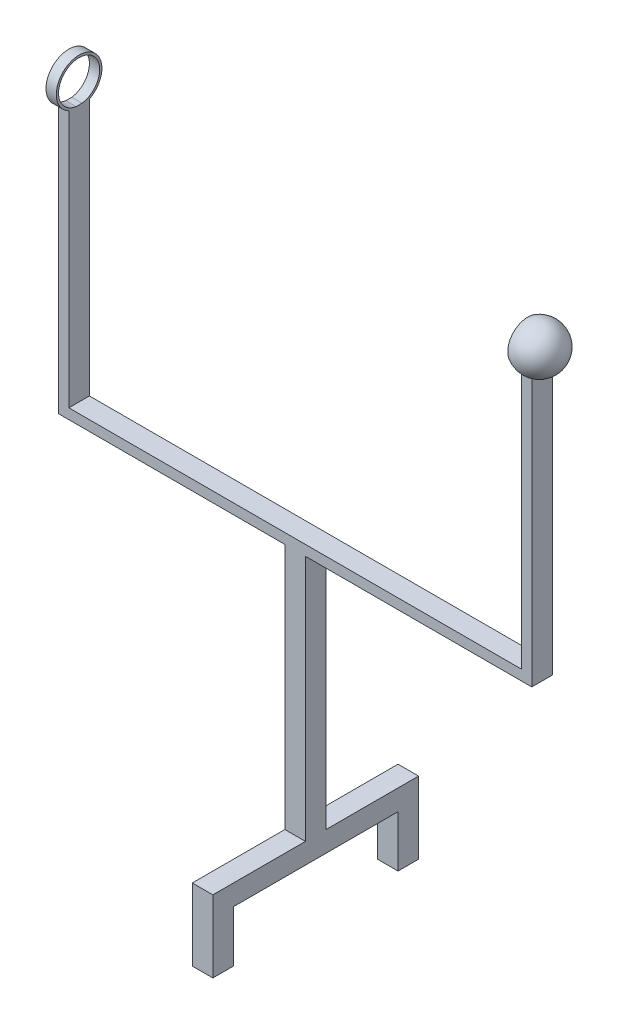
ISO-10303-21;
HEADER;
FILE_DESCRIPTION(('STEP AP214'),'2;1');
FILE_NAME('part.step','',(''),(''),'','','');
FILE_SCHEMA(('AUTOMOTIVE_DESIGN { 1 0 10303 214 1 1 1 1 }'));
ENDSEC;
DATA;
#1=APPLICATION_CONTEXT('core data for automotive mechanical design processes');
#2=APPLICATION_PROTOCOL_DEFINITION('international standard','automotive_design',2000,#1);
#3=PRODUCT_CONTEXT('',#1,'mechanical');
#4=PRODUCT('Part','Part','',(#3));
#5=PRODUCT_RELATED_PRODUCT_CATEGORY('part','',(#4));
#6=PRODUCT_DEFINITION_FORMATION('','',#4);
#7=PRODUCT_DEFINITION_CONTEXT('part definition',#1,'design');
#8=PRODUCT_DEFINITION('design','',#6,#7);
#9=PRODUCT_DEFINITION_SHAPE('','',#8);
#10=(LENGTH_UNIT() NAMED_UNIT(*) SI_UNIT(.MILLI.,.METRE.));
#11=(NAMED_UNIT(*) PLANE_ANGLE_UNIT() SI_UNIT($,.RADIAN.));
#12=(NAMED_UNIT(*) SI_UNIT($,.STERADIAN.) SOLID_ANGLE_UNIT());
#13=UNCERTAINTY_MEASURE_WITH_UNIT(LENGTH_MEASURE(1.E-05),#10,'distance_accuracy_value','');
#14=(GEOMETRIC_REPRESENTATION_CONTEXT(3) GLOBAL_UNCERTAINTY_ASSIGNED_CONTEXT((#13)) GLOBAL_UNIT_ASSIGNED_CONTEXT((#10,
#11,#12)) REPRESENTATION_CONTEXT('',''));
#15=CARTESIAN_POINT('',(0.,0.,0.));
#16=DIRECTION('',(0.,0.,1.));
#17=DIRECTION('',(1.,0.,0.));
#18=AXIS2_PLACEMENT_3D('',#15,#16,#17);
#19=CARTESIAN_POINT('',(-44.,100.,-2.));
#20=DIRECTION('',(0.,-1.,0.));
#21=DIRECTION('',(0.,0.,-1.));
#22=AXIS2_PLACEMENT_3D('',#19,#20,#21);
#23=PLANE('',#22);
#24=DIRECTION('',(-1.,0.,0.));
#25=VECTOR('',#24,1.);
#26=CARTESIAN_POINT('',(-31.4553608105313,100.,0.573588224038669));
#27=LINE('',#26,#25);
#28=CARTESIAN_POINT('',(-44.,100.,0.573588224038669));
#29=VERTEX_POINT('',#28);
#30=CARTESIAN_POINT('',(-46.,100.,0.573588224038669));
#31=VERTEX_POINT('',#30);
#32=EDGE_CURVE('E209',#29,#31,#27,.T.);
#33=ORIENTED_EDGE('',*,*,#32,.F.);
#34=DIRECTION('',(0.,0.,1.));
#35=VECTOR('',#34,1.);
#36=CARTESIAN_POINT('',(-44.,100.,-2.));
#37=LINE('',#36,#35);
#38=CARTESIAN_POINT('',(-44.,100.,-0.573588224038669));
#39=VERTEX_POINT('',#38);
#40=EDGE_CURVE('E218',#39,#29,#37,.T.);
#41=ORIENTED_EDGE('',*,*,#40,.F.);
#42=DIRECTION('',(-1.,0.,0.));
#43=VECTOR('',#42,1.);
#44=CARTESIAN_POINT('',(-31.4553608105313,100.,-0.573588224038669));
#45=LINE('',#44,#43);
#46=CARTESIAN_POINT('',(-46.,100.,-0.573588224038669));
#47=VERTEX_POINT('',#46);
#48=EDGE_CURVE('E212',#47,#39,#45,.F.);
#49=ORIENTED_EDGE('',*,*,#48,.F.);
#50=DIRECTION('',(0.,0.,1.));
#51=VECTOR('',#50,1.);
#52=CARTESIAN_POINT('',(-46.,100.,-2.));
#53=LINE('',#52,#51);
#54=EDGE_CURVE('E220',#47,#31,#53,.T.);
#55=ORIENTED_EDGE('',*,*,#54,.T.);
#56=EDGE_LOOP('',(#33,#41,#49,#55));
#57=FACE_BOUND('',#56,.T.);
#58=ADVANCED_FACE('F33',(#57),#23,.F.);
#59=CARTESIAN_POINT('',(-2.,-4.,20.));
#60=DIRECTION('',(0.,1.,0.));
#61=DIRECTION('',(-1.,0.,0.));
#62=AXIS2_PLACEMENT_3D('',#59,#60,#61);
#63=PLANE('',#62);
#64=DIRECTION('',(0.,0.,-1.));
#65=VECTOR('',#64,1.);
#66=CARTESIAN_POINT('',(-2.,-4.,20.));
#67=LINE('',#66,#65);
#68=CARTESIAN_POINT('',(-2.,-4.,16.));
#69=VERTEX_POINT('',#68);
#70=CARTESIAN_POINT('',(-2.,-4.,-16.));
#71=VERTEX_POINT('',#70);
#72=EDGE_CURVE('E406',#69,#71,#67,.T.);
#73=ORIENTED_EDGE('',*,*,#72,.T.);
#74=DIRECTION('',(1.,0.,0.));
#75=VECTOR('',#74,1.);
#76=CARTESIAN_POINT('',(-2.,-4.,-16.));
#77=LINE('',#76,#75);
#78=CARTESIAN_POINT('',(2.,-4.,-16.));
#79=VERTEX_POINT('',#78);
#80=EDGE_CURVE('E55',#71,#79,#77,.T.);
#81=ORIENTED_EDGE('',*,*,#80,.T.);
#82=DIRECTION('',(0.,0.,-1.));
#83=VECTOR('',#82,1.);
#84=CARTESIAN_POINT('',(2.,-4.,20.));
#85=LINE('',#84,#83);
#86=CARTESIAN_POINT('',(2.,-4.,16.));
#87=VERTEX_POINT('',#86);
#88=EDGE_CURVE('E407',#87,#79,#85,.T.);
#89=ORIENTED_EDGE('',*,*,#88,.F.);
#90=DIRECTION('',(1.,0.,0.));
#91=VECTOR('',#90,1.);
#92=CARTESIAN_POINT('',(-2.,-4.,16.));
#93=LINE('',#92,#91);
#94=EDGE_CURVE('E424',#69,#87,#93,.T.);
#95=ORIENTED_EDGE('',*,*,#94,.F.);
#96=EDGE_LOOP('',(#73,#81,#89,#95));
#97=FACE_BOUND('',#96,.T.);
#98=ADVANCED_FACE('F484',(#97),#63,.F.);
#99=CARTESIAN_POINT('',(44.,100.,-2.));
#100=DIRECTION('',(0.,1.,0.));
#101=DIRECTION('',(0.,0.,1.));
#102=AXIS2_PLACEMENT_3D('',#99,#100,#101);
#103=PLANE('',#102);
#104=CARTESIAN_POINT('',(45.4806811737032,100.,0.));
#105=DIRECTION('',(0.,1.,0.));
#106=DIRECTION('',(0.,0.,1.));
#107=AXIS2_PLACEMENT_3D('',#104,#105,#106);
#108=CIRCLE('',#107,2.06155281280883);
#109=CARTESIAN_POINT('',(45.9806811737031,100.,2.));
#110=VERTEX_POINT('',#109);
#111=CARTESIAN_POINT('',(46.,100.,1.99507091519416));
#112=VERTEX_POINT('',#111);
#113=EDGE_CURVE('E241',#110,#112,#108,.T.);
#114=ORIENTED_EDGE('',*,*,#113,.F.);
#115=DIRECTION('',(-1.,0.,0.));
#116=VECTOR('',#115,1.);
#117=CARTESIAN_POINT('',(44.,100.,2.));
#118=LINE('',#117,#116);
#119=CARTESIAN_POINT('',(46.,100.,2.));
#120=VERTEX_POINT('',#119);
#121=EDGE_CURVE('E263',#120,#110,#118,.T.);
#122=ORIENTED_EDGE('',*,*,#121,.F.);
#123=DIRECTION('',(0.,0.,1.));
#124=VECTOR('',#123,1.);
#125=CARTESIAN_POINT('',(46.,100.,-2.));
#126=LINE('',#125,#124);
#127=EDGE_CURVE('E300',#112,#120,#126,.T.);
#128=ORIENTED_EDGE('',*,*,#127,.F.);
#129=EDGE_LOOP('',(#114,#122,#128));
#130=FACE_BOUND('',#129,.T.);
#131=ADVANCED_FACE('F332',(#130),#103,.T.);
#132=CARTESIAN_POINT('',(46.,100.,-1.99507091519416));
#133=VERTEX_POINT('',#132);
#134=CARTESIAN_POINT('',(45.9806811737031,100.,-2.));
#135=VERTEX_POINT('',#134);
#136=EDGE_CURVE('E242',#133,#135,#108,.T.);
#137=ORIENTED_EDGE('',*,*,#136,.F.);
#138=CARTESIAN_POINT('',(46.,100.,-2.));
#139=VERTEX_POINT('',#138);
#140=EDGE_CURVE('E297',#139,#133,#126,.T.);
#141=ORIENTED_EDGE('',*,*,#140,.F.);
#142=DIRECTION('',(-1.,0.,0.));
#143=VECTOR('',#142,1.);
#144=CARTESIAN_POINT('',(44.,100.,-2.));
#145=LINE('',#144,#143);
#146=EDGE_CURVE('E283',#139,#135,#145,.T.);
#147=ORIENTED_EDGE('',*,*,#146,.T.);
#148=EDGE_LOOP('',(#137,#141,#147));
#149=FACE_BOUND('',#148,.T.);
#150=ADVANCED_FACE('F326',(#149),#103,.T.);
#151=CARTESIAN_POINT('',(44.9806811737032,100.,-2.));
#152=VERTEX_POINT('',#151);
#153=CARTESIAN_POINT('',(44.,100.,-1.43442785173777));
#154=VERTEX_POINT('',#153);
#155=EDGE_CURVE('E247',#152,#154,#108,.T.);
#156=ORIENTED_EDGE('',*,*,#155,.F.);
#157=CARTESIAN_POINT('',(44.,100.,-2.));
#158=VERTEX_POINT('',#157);
#159=EDGE_CURVE('E282',#152,#158,#145,.T.);
#160=ORIENTED_EDGE('',*,*,#159,.T.);
#161=DIRECTION('',(0.,0.,1.));
#162=VECTOR('',#161,1.);
#163=CARTESIAN_POINT('',(44.,100.,-2.));
#164=LINE('',#163,#162);
#165=EDGE_CURVE('E293',#158,#154,#164,.T.);
#166=ORIENTED_EDGE('',*,*,#165,.T.);
#167=EDGE_LOOP('',(#156,#160,#166));
#168=FACE_BOUND('',#167,.T.);
#169=ADVANCED_FACE('F507',(#168),#103,.T.);
#170=CARTESIAN_POINT('',(0.,50.,-2.));
#171=DIRECTION('',(0.,1.,0.));
#172=DIRECTION('',(0.,0.,1.));
#173=AXIS2_PLACEMENT_3D('',#170,#171,#172);
#174=PLANE('',#173);
#175=DIRECTION('',(-1.,0.,0.));
#176=VECTOR('',#175,1.);
#177=CARTESIAN_POINT('',(0.,50.,-2.));
#178=LINE('',#177,#176);
#179=CARTESIAN_POINT('',(44.,50.,-2.));
#180=VERTEX_POINT('',#179);
#181=CARTESIAN_POINT('',(-44.,50.,-2.));
#182=VERTEX_POINT('',#181);
#183=EDGE_CURVE('E289',#180,#182,#178,.T.);
#184=ORIENTED_EDGE('',*,*,#183,.T.);
#185=DIRECTION('',(0.,0.,1.));
#186=VECTOR('',#185,1.);
#187=CARTESIAN_POINT('',(-44.,50.,-2.));
#188=LINE('',#187,#186);
#189=CARTESIAN_POINT('',(-44.,50.,2.));
#190=VERTEX_POINT('',#189);
#191=EDGE_CURVE('E223',#182,#190,#188,.T.);
#192=ORIENTED_EDGE('',*,*,#191,.T.);
#193=DIRECTION('',(-1.,0.,0.));
#194=VECTOR('',#193,1.);
#195=CARTESIAN_POINT('',(0.,50.,2.));
#196=LINE('',#195,#194);
#197=CARTESIAN_POINT('',(44.,50.,2.));
#198=VERTEX_POINT('',#197);
#199=EDGE_CURVE('E269',#198,#190,#196,.T.);
#200=ORIENTED_EDGE('',*,*,#199,.F.);
#201=DIRECTION('',(0.,0.,1.));
#202=VECTOR('',#201,1.);
#203=CARTESIAN_POINT('',(44.,50.,-2.));
#204=LINE('',#203,#202);
#205=EDGE_CURVE('E41',#180,#198,#204,.T.);
#206=ORIENTED_EDGE('',*,*,#205,.F.);
#207=EDGE_LOOP('',(#184,#192,#200,#206));
#208=FACE_BOUND('',#207,.T.);
#209=ADVANCED_FACE('F347',(#208),#174,.T.);
#210=CARTESIAN_POINT('',(44.,50.,-2.));
#211=DIRECTION('',(-1.,0.,0.));
#212=DIRECTION('',(0.,0.,1.));
#213=AXIS2_PLACEMENT_3D('',#210,#211,#212);
#214=PLANE('',#213);
#215=CARTESIAN_POINT('',(44.,104.,0.));
#216=DIRECTION('',(-1.,0.,0.));
#217=DIRECTION('',(0.,0.,1.));
#218=AXIS2_PLACEMENT_3D('',#215,#216,#217);
#219=CIRCLE('',#218,4.24942152084741);
#220=CARTESIAN_POINT('',(44.,100.,1.43442785173777));
#221=VERTEX_POINT('',#220);
#222=EDGE_CURVE('E243',#154,#221,#219,.T.);
#223=ORIENTED_EDGE('',*,*,#222,.F.);
#224=ORIENTED_EDGE('',*,*,#165,.F.);
#225=DIRECTION('',(0.,-1.,0.));
#226=VECTOR('',#225,1.);
#227=CARTESIAN_POINT('',(44.,50.,-2.));
#228=LINE('',#227,#226);
#229=EDGE_CURVE('E286',#158,#180,#228,.T.);
#230=ORIENTED_EDGE('',*,*,#229,.T.);
#231=ORIENTED_EDGE('',*,*,#205,.T.);
#232=DIRECTION('',(0.,-1.,0.));
#233=VECTOR('',#232,1.);
#234=CARTESIAN_POINT('',(44.,50.,2.));
#235=LINE('',#234,#233);
#236=CARTESIAN_POINT('',(44.,100.,2.));
#237=VERTEX_POINT('',#236);
#238=EDGE_CURVE('E266',#237,#198,#235,.T.);
#239=ORIENTED_EDGE('',*,*,#238,.F.);
#240=EDGE_CURVE('E296',#221,#237,#164,.T.);
#241=ORIENTED_EDGE('',*,*,#240,.F.);
#242=EDGE_LOOP('',(#223,#224,#230,#231,#239,#241));
#243=FACE_BOUND('',#242,.T.);
#244=ADVANCED_FACE('F342',(#243),#214,.T.);
#245=CARTESIAN_POINT('',(44.9806811737032,100.,2.));
#246=VERTEX_POINT('',#245);
#247=EDGE_CURVE('E239',#221,#246,#108,.T.);
#248=ORIENTED_EDGE('',*,*,#247,.F.);
#249=ORIENTED_EDGE('',*,*,#240,.T.);
#250=EDGE_CURVE('E262',#246,#237,#118,.T.);
#251=ORIENTED_EDGE('',*,*,#250,.F.);
#252=EDGE_LOOP('',(#248,#249,#251));
#253=FACE_BOUND('',#252,.T.);
#254=ADVANCED_FACE('F338',(#253),#103,.T.);
#255=CARTESIAN_POINT('',(46.,100.,-2.));
#256=DIRECTION('',(1.,0.,0.));
#257=DIRECTION('',(0.,1.,0.));
#258=AXIS2_PLACEMENT_3D('',#255,#256,#257);
#259=PLANE('',#258);
#260=CARTESIAN_POINT('',(46.,104.,0.));
#261=DIRECTION('',(1.,0.,0.));
#262=DIRECTION('',(0.,1.,0.));
#263=AXIS2_PLACEMENT_3D('',#260,#261,#262);
#264=CIRCLE('',#263,4.46993377542148);
#265=EDGE_CURVE('E245',#112,#133,#264,.T.);
#266=ORIENTED_EDGE('',*,*,#265,.F.);
#267=ORIENTED_EDGE('',*,*,#127,.T.);
#268=DIRECTION('',(0.,1.,0.));
#269=VECTOR('',#268,1.);
#270=CARTESIAN_POINT('',(46.,100.,2.));
#271=LINE('',#270,#269);
#272=CARTESIAN_POINT('',(46.,48.,2.));
#273=VERTEX_POINT('',#272);
#274=EDGE_CURVE('E259',#273,#120,#271,.T.);
#275=ORIENTED_EDGE('',*,*,#274,.F.);
#276=DIRECTION('',(0.,0.,1.));
#277=VECTOR('',#276,1.);
#278=CARTESIAN_POINT('',(46.,48.,-2.));
#279=LINE('',#278,#277);
#280=CARTESIAN_POINT('',(46.,48.,-2.));
#281=VERTEX_POINT('',#280);
#282=EDGE_CURVE('E301',#281,#273,#279,.T.);
#283=ORIENTED_EDGE('',*,*,#282,.F.);
#284=DIRECTION('',(0.,1.,0.));
#285=VECTOR('',#284,1.);
#286=CARTESIAN_POINT('',(46.,100.,-2.));
#287=LINE('',#286,#285);
#288=EDGE_CURVE('E279',#281,#139,#287,.T.);
#289=ORIENTED_EDGE('',*,*,#288,.T.);
#290=ORIENTED_EDGE('',*,*,#140,.T.);
#291=EDGE_LOOP('',(#266,#267,#275,#283,#289,#290));
#292=FACE_BOUND('',#291,.T.);
#293=ADVANCED_FACE('F318',(#292),#259,.T.);
#294=CARTESIAN_POINT('',(46.,48.,-2.));
#295=DIRECTION('',(0.,-1.,0.));
#296=DIRECTION('',(1.,0.,0.));
#297=AXIS2_PLACEMENT_3D('',#294,#295,#296);
#298=PLANE('',#297);
#299=ORIENTED_EDGE('',*,*,#282,.T.);
#300=DIRECTION('',(1.,0.,0.));
#301=VECTOR('',#300,1.);
#302=CARTESIAN_POINT('',(46.,48.,2.));
#303=LINE('',#302,#301);
#304=CARTESIAN_POINT('',(2.,48.,2.));
#305=VERTEX_POINT('',#304);
#306=EDGE_CURVE('E256',#305,#273,#303,.T.);
#307=ORIENTED_EDGE('',*,*,#306,.F.);
#308=DIRECTION('',(0.,0.,1.));
#309=VECTOR('',#308,1.);
#310=CARTESIAN_POINT('',(2.,48.,-2.));
#311=LINE('',#310,#309);
#312=CARTESIAN_POINT('',(2.,48.,-2.));
#313=VERTEX_POINT('',#312);
#314=EDGE_CURVE('E291',#313,#305,#311,.T.);
#315=ORIENTED_EDGE('',*,*,#314,.F.);
#316=DIRECTION('',(1.,0.,0.));
#317=VECTOR('',#316,1.);
#318=CARTESIAN_POINT('',(46.,48.,-2.));
#319=LINE('',#318,#317);
#320=EDGE_CURVE('E276',#313,#281,#319,.T.);
#321=ORIENTED_EDGE('',*,*,#320,.T.);
#322=EDGE_LOOP('',(#299,#307,#315,#321));
#323=FACE_BOUND('',#322,.T.);
#324=ADVANCED_FACE('F314',(#323),#298,.T.);
#325=CARTESIAN_POINT('',(2.,48.,-2.));
#326=DIRECTION('',(1.,0.,0.));
#327=DIRECTION('',(0.,1.,0.));
#328=AXIS2_PLACEMENT_3D('',#325,#326,#327);
#329=PLANE('',#328);
#330=ORIENTED_EDGE('',*,*,#314,.T.);
#331=DIRECTION('',(0.,1.,0.));
#332=VECTOR('',#331,1.);
#333=CARTESIAN_POINT('',(2.,48.,2.));
#334=LINE('',#333,#332);
#335=CARTESIAN_POINT('',(2.,0.,2.));
#336=VERTEX_POINT('',#335);
#337=EDGE_CURVE('E253',#336,#305,#334,.T.);
#338=ORIENTED_EDGE('',*,*,#337,.F.);
#339=DIRECTION('',(0.,0.,-1.));
#340=VECTOR('',#339,1.);
#341=CARTESIAN_POINT('',(2.,0.,20.));
#342=LINE('',#341,#340);
#343=CARTESIAN_POINT('',(2.,0.,20.));
#344=VERTEX_POINT('',#343);
#345=EDGE_CURVE('E358',#344,#336,#342,.T.);
#346=ORIENTED_EDGE('',*,*,#345,.F.);
#347=DIRECTION('',(0.,1.,0.));
#348=VECTOR('',#347,1.);
#349=CARTESIAN_POINT('',(2.,-4.,20.));
#350=LINE('',#349,#348);
#351=CARTESIAN_POINT('',(2.00000000000001,-14.,20.));
#352=VERTEX_POINT('',#351);
#353=EDGE_CURVE('E414',#352,#344,#350,.T.);
#354=ORIENTED_EDGE('',*,*,#353,.F.);
#355=DIRECTION('',(0.,0.,1.));
#356=VECTOR('',#355,1.);
#357=CARTESIAN_POINT('',(2.00000000000001,-14.,20.));
#358=LINE('',#357,#356);
#359=CARTESIAN_POINT('',(2.00000000000001,-14.,16.));
#360=VERTEX_POINT('',#359);
#361=EDGE_CURVE('E431',#360,#352,#358,.T.);
#362=ORIENTED_EDGE('',*,*,#361,.F.);
#363=DIRECTION('',(0.,1.,0.));
#364=VECTOR('',#363,1.);
#365=CARTESIAN_POINT('',(2.00000000000001,-14.,16.));
#366=LINE('',#365,#364);
#367=EDGE_CURVE('E420',#360,#87,#366,.T.);
#368=ORIENTED_EDGE('',*,*,#367,.T.);
#369=ORIENTED_EDGE('',*,*,#88,.T.);
#370=DIRECTION('',(0.,1.,0.));
#371=VECTOR('',#370,1.);
#372=CARTESIAN_POINT('',(2.00000000000001,-14.,-16.));
#373=LINE('',#372,#371);
#374=CARTESIAN_POINT('',(2.00000000000001,-14.,-16.));
#375=VERTEX_POINT('',#374);
#376=EDGE_CURVE('E449',#375,#79,#373,.T.);
#377=ORIENTED_EDGE('',*,*,#376,.F.);
#378=DIRECTION('',(0.,0.,-1.));
#379=VECTOR('',#378,1.);
#380=CARTESIAN_POINT('',(2.00000000000001,-14.,-20.));
#381=LINE('',#380,#379);
#382=CARTESIAN_POINT('',(2.00000000000001,-14.,-20.));
#383=VERTEX_POINT('',#382);
#384=EDGE_CURVE('E460',#375,#383,#381,.T.);
#385=ORIENTED_EDGE('',*,*,#384,.T.);
#386=DIRECTION('',(0.,1.,0.));
#387=VECTOR('',#386,1.);
#388=CARTESIAN_POINT('',(2.,-4.,-20.));
#389=LINE('',#388,#387);
#390=CARTESIAN_POINT('',(2.,0.,-20.));
#391=VERTEX_POINT('',#390);
#392=EDGE_CURVE('E446',#383,#391,#389,.T.);
#393=ORIENTED_EDGE('',*,*,#392,.T.);
#394=DIRECTION('',(0.,0.,1.));
#395=VECTOR('',#394,1.);
#396=CARTESIAN_POINT('',(2.,0.,-20.));
#397=LINE('',#396,#395);
#398=CARTESIAN_POINT('',(2.,0.,-2.));
#399=VERTEX_POINT('',#398);
#400=EDGE_CURVE('E439',#391,#399,#397,.T.);
#401=ORIENTED_EDGE('',*,*,#400,.T.);
#402=DIRECTION('',(0.,1.,0.));
#403=VECTOR('',#402,1.);
#404=CARTESIAN_POINT('',(2.,48.,-2.));
#405=LINE('',#404,#403);
#406=EDGE_CURVE('E273',#399,#313,#405,.T.);
#407=ORIENTED_EDGE('',*,*,#406,.T.);
#408=EDGE_LOOP('',(#330,#338,#346,#354,#362,#368,#369,#377,#385,#393,#401,#407));
#409=FACE_BOUND('',#408,.T.);
#410=ADVANCED_FACE('F35',(#409),#329,.T.);
#411=CARTESIAN_POINT('',(0.,0.,-2.));
#412=DIRECTION('',(0.,0.,-1.));
#413=DIRECTION('',(-1.,0.,0.));
#414=AXIS2_PLACEMENT_3D('',#411,#412,#413);
#415=PLANE('',#414);
#416=CARTESIAN_POINT('',(45.4806811737032,104.,-2.));
#417=DIRECTION('',(0.,0.,-1.));
#418=DIRECTION('',(-1.,0.,0.));
#419=AXIS2_PLACEMENT_3D('',#416,#417,#418);
#420=CIRCLE('',#419,4.03112887414928);
#421=EDGE_CURVE('E248',#135,#152,#420,.T.);
#422=ORIENTED_EDGE('',*,*,#421,.F.);
#423=ORIENTED_EDGE('',*,*,#146,.F.);
#424=ORIENTED_EDGE('',*,*,#288,.F.);
#425=ORIENTED_EDGE('',*,*,#320,.F.);
#426=ORIENTED_EDGE('',*,*,#406,.F.);
#427=DIRECTION('',(1.,0.,0.));
#428=VECTOR('',#427,1.);
#429=CARTESIAN_POINT('',(2.,0.,-2.));
#430=LINE('',#429,#428);
#431=CARTESIAN_POINT('',(-2.,0.,-2.));
#432=VERTEX_POINT('',#431);
#433=EDGE_CURVE('E271',#432,#399,#430,.T.);
#434=ORIENTED_EDGE('',*,*,#433,.F.);
#435=DIRECTION('',(0.,1.,0.));
#436=VECTOR('',#435,1.);
#437=CARTESIAN_POINT('',(-2.,48.,-2.));
#438=LINE('',#437,#436);
#439=CARTESIAN_POINT('',(-2.,48.,-2.));
#440=VERTEX_POINT('',#439);
#441=EDGE_CURVE('E228',#432,#440,#438,.T.);
#442=ORIENTED_EDGE('',*,*,#441,.T.);
#443=DIRECTION('',(-1.,0.,0.));
#444=VECTOR('',#443,1.);
#445=CARTESIAN_POINT('',(-46.,48.,-2.));
#446=LINE('',#445,#444);
#447=CARTESIAN_POINT('',(-46.,48.,-2.));
#448=VERTEX_POINT('',#447);
#449=EDGE_CURVE('E382',#440,#448,#446,.T.);
#450=ORIENTED_EDGE('',*,*,#449,.T.);
#451=DIRECTION('',(0.,1.,0.));
#452=VECTOR('',#451,1.);
#453=CARTESIAN_POINT('',(-46.,100.,-2.));
#454=LINE('',#453,#452);
#455=CARTESIAN_POINT('',(-46.,100.,-2.));
#456=VERTEX_POINT('',#455);
#457=EDGE_CURVE('E379',#448,#456,#454,.T.);
#458=ORIENTED_EDGE('',*,*,#457,.T.);
#459=DIRECTION('',(1.,0.,0.));
#460=VECTOR('',#459,1.);
#461=CARTESIAN_POINT('',(-44.,100.,-2.));
#462=LINE('',#461,#460);
#463=CARTESIAN_POINT('',(-44.,100.,-2.));
#464=VERTEX_POINT('',#463);
#465=EDGE_CURVE('E376',#456,#464,#462,.T.);
#466=ORIENTED_EDGE('',*,*,#465,.T.);
#467=DIRECTION('',(0.,-1.,0.));
#468=VECTOR('',#467,1.);
#469=CARTESIAN_POINT('',(-44.,50.,-2.));
#470=LINE('',#469,#468);
#471=EDGE_CURVE('E374',#464,#182,#470,.T.);
#472=ORIENTED_EDGE('',*,*,#471,.T.);
#473=ORIENTED_EDGE('',*,*,#183,.F.);
#474=ORIENTED_EDGE('',*,*,#229,.F.);
#475=ORIENTED_EDGE('',*,*,#159,.F.);
#476=EDGE_LOOP('',(#422,#423,#424,#425,#426,#434,#442,#450,#458,#466,#472,#473,#474,#475));
#477=FACE_BOUND('',#476,.T.);
#478=ADVANCED_FACE('F322',(#477),#415,.T.);
#479=CARTESIAN_POINT('',(0.,0.,2.));
#480=DIRECTION('',(0.,0.,-1.));
#481=DIRECTION('',(-1.,0.,0.));
#482=AXIS2_PLACEMENT_3D('',#479,#480,#481);
#483=PLANE('',#482);
#484=ORIENTED_EDGE('',*,*,#121,.T.);
#485=CARTESIAN_POINT('',(45.4806811737032,104.,2.));
#486=DIRECTION('',(0.,0.,-1.));
#487=DIRECTION('',(-1.,0.,0.));
#488=AXIS2_PLACEMENT_3D('',#485,#486,#487);
#489=CIRCLE('',#488,4.03112887414928);
#490=EDGE_CURVE('E11',#110,#246,#489,.T.);
#491=ORIENTED_EDGE('',*,*,#490,.T.);
#492=ORIENTED_EDGE('',*,*,#250,.T.);
#493=ORIENTED_EDGE('',*,*,#238,.T.);
#494=ORIENTED_EDGE('',*,*,#199,.T.);
#495=DIRECTION('',(0.,-1.,0.));
#496=VECTOR('',#495,1.);
#497=CARTESIAN_POINT('',(-44.,50.,2.));
#498=LINE('',#497,#496);
#499=CARTESIAN_POINT('',(-44.,100.,2.));
#500=VERTEX_POINT('',#499);
#501=EDGE_CURVE('E354',#500,#190,#498,.T.);
#502=ORIENTED_EDGE('',*,*,#501,.F.);
#503=DIRECTION('',(1.,0.,0.));
#504=VECTOR('',#503,1.);
#505=CARTESIAN_POINT('',(-44.,100.,2.));
#506=LINE('',#505,#504);
#507=CARTESIAN_POINT('',(-46.,100.,2.));
#508=VERTEX_POINT('',#507);
#509=EDGE_CURVE('E357',#508,#500,#506,.T.);
#510=ORIENTED_EDGE('',*,*,#509,.F.);
#511=DIRECTION('',(0.,1.,0.));
#512=VECTOR('',#511,1.);
#513=CARTESIAN_POINT('',(-46.,100.,2.));
#514=LINE('',#513,#512);
#515=CARTESIAN_POINT('',(-46.,48.,2.));
#516=VERTEX_POINT('',#515);
#517=EDGE_CURVE('E360',#516,#508,#514,.T.);
#518=ORIENTED_EDGE('',*,*,#517,.F.);
#519=DIRECTION('',(-1.,0.,0.));
#520=VECTOR('',#519,1.);
#521=CARTESIAN_POINT('',(-46.,48.,2.));
#522=LINE('',#521,#520);
#523=CARTESIAN_POINT('',(-2.,48.,2.));
#524=VERTEX_POINT('',#523);
#525=EDGE_CURVE('E368',#524,#516,#522,.T.);
#526=ORIENTED_EDGE('',*,*,#525,.F.);
#527=DIRECTION('',(0.,1.,0.));
#528=VECTOR('',#527,1.);
#529=CARTESIAN_POINT('',(-2.,48.,2.));
#530=LINE('',#529,#528);
#531=CARTESIAN_POINT('',(-2.,0.,2.));
#532=VERTEX_POINT('',#531);
#533=EDGE_CURVE('E371',#532,#524,#530,.T.);
#534=ORIENTED_EDGE('',*,*,#533,.F.);
#535=DIRECTION('',(1.,0.,0.));
#536=VECTOR('',#535,1.);
#537=CARTESIAN_POINT('',(2.,0.,2.));
#538=LINE('',#537,#536);
#539=EDGE_CURVE('E250',#532,#336,#538,.T.);
#540=ORIENTED_EDGE('',*,*,#539,.T.);
#541=ORIENTED_EDGE('',*,*,#337,.T.);
#542=ORIENTED_EDGE('',*,*,#306,.T.);
#543=ORIENTED_EDGE('',*,*,#274,.T.);
#544=EDGE_LOOP('',(#484,#491,#492,#493,#494,#502,#510,#518,#526,#534,#540,#541,#542,#543));
#545=FACE_BOUND('',#544,.T.);
#546=ADVANCED_FACE('F311',(#545),#483,.F.);
#547=CARTESIAN_POINT('',(45.4806811737032,104.,0.));
#548=DIRECTION('',(1.,0.,0.));
#549=DIRECTION('',(0.,-1.,0.));
#550=AXIS2_PLACEMENT_3D('',#547,#548,#549);
#551=SPHERICAL_SURFACE('',#550,4.5);
#552=ORIENTED_EDGE('',*,*,#136,.T.);
#553=ORIENTED_EDGE('',*,*,#421,.T.);
#554=ORIENTED_EDGE('',*,*,#155,.T.);
#555=ORIENTED_EDGE('',*,*,#222,.T.);
#556=ORIENTED_EDGE('',*,*,#247,.T.);
#557=ORIENTED_EDGE('',*,*,#490,.F.);
#558=ORIENTED_EDGE('',*,*,#113,.T.);
#559=ORIENTED_EDGE('',*,*,#265,.T.);
#560=EDGE_LOOP('',(#552,#553,#554,#555,#556,#557,#558,#559));
#561=FACE_BOUND('',#560,.T.);
#562=CARTESIAN_POINT('',(43.2306811737031,104.,0.));
#563=DIRECTION('',(1.,0.,0.));
#564=DIRECTION('',(0.,0.,-1.));
#565=AXIS2_PLACEMENT_3D('',#562,#563,#564);
#566=CIRCLE('',#565,3.89711431702997);
#567=CARTESIAN_POINT('',(43.2306811737031,104.,-3.89711431702997));
#568=VERTEX_POINT('',#567);
#569=EDGE_CURVE('E232',#568,#568,#566,.T.);
#570=ORIENTED_EDGE('',*,*,#569,.T.);
#571=EDGE_LOOP('',(#570));
#572=FACE_BOUND('',#571,.T.);
#573=ADVANCED_FACE('F497',(#561,#572),#551,.T.);
#574=CARTESIAN_POINT('',(45.4806811737032,104.,0.));
#575=DIRECTION('',(1.,0.,0.));
#576=DIRECTION('',(0.,1.,0.));
#577=AXIS2_PLACEMENT_3D('',#574,#575,#576);
#578=SPHERICAL_SURFACE('',#577,4.);
#579=CARTESIAN_POINT('',(45.4806811737032,100.,0.));
#580=VERTEX_POINT('',#579);
#581=VERTEX_LOOP('',#580);
#582=FACE_BOUND('',#581,.T.);
#583=CARTESIAN_POINT('',(43.4806811737031,104.,0.));
#584=DIRECTION('',(1.,0.,0.));
#585=DIRECTION('',(0.,0.,-1.));
#586=AXIS2_PLACEMENT_3D('',#583,#584,#585);
#587=CIRCLE('',#586,3.46410161513774);
#588=CARTESIAN_POINT('',(43.4806811737031,104.,-3.46410161513774));
#589=VERTEX_POINT('',#588);
#590=EDGE_CURVE('E235',#589,#589,#587,.T.);
#591=ORIENTED_EDGE('',*,*,#590,.F.);
#592=EDGE_LOOP('',(#591));
#593=FACE_BOUND('',#592,.T.);
#594=ADVANCED_FACE('F493',(#582,#593),#578,.F.);
#595=CARTESIAN_POINT('',(43.2306811737031,104.,0.));
#596=DIRECTION('',(-1.,0.,0.));
#597=DIRECTION('',(0.,0.,1.));
#598=AXIS2_PLACEMENT_3D('',#595,#596,#597);
#599=CONICAL_SURFACE('',#598,3.89711431702997,1.04719755119656);
#600=ORIENTED_EDGE('',*,*,#590,.T.);
#601=EDGE_LOOP('',(#600));
#602=FACE_BOUND('',#601,.T.);
#603=ORIENTED_EDGE('',*,*,#569,.F.);
#604=EDGE_LOOP('',(#603));
#605=FACE_BOUND('',#604,.T.);
#606=ADVANCED_FACE('F490',(#602,#605),#599,.F.);
#607=CARTESIAN_POINT('',(-2.,48.,-2.));
#608=DIRECTION('',(1.,0.,0.));
#609=DIRECTION('',(0.,1.,0.));
#610=AXIS2_PLACEMENT_3D('',#607,#608,#609);
#611=PLANE('',#610);
#612=ORIENTED_EDGE('',*,*,#441,.F.);
#613=DIRECTION('',(0.,0.,1.));
#614=VECTOR('',#613,1.);
#615=CARTESIAN_POINT('',(-2.,0.,-20.));
#616=LINE('',#615,#614);
#617=CARTESIAN_POINT('',(-2.,0.,-20.));
#618=VERTEX_POINT('',#617);
#619=EDGE_CURVE('E428',#618,#432,#616,.T.);
#620=ORIENTED_EDGE('',*,*,#619,.F.);
#621=DIRECTION('',(0.,-1.,0.));
#622=VECTOR('',#621,1.);
#623=CARTESIAN_POINT('',(-2.,-4.,-20.));
#624=LINE('',#623,#622);
#625=CARTESIAN_POINT('',(-1.99999999999999,-14.,-20.));
#626=VERTEX_POINT('',#625);
#627=EDGE_CURVE('E444',#618,#626,#624,.T.);
#628=ORIENTED_EDGE('',*,*,#627,.T.);
#629=DIRECTION('',(0.,0.,1.));
#630=VECTOR('',#629,1.);
#631=CARTESIAN_POINT('',(-1.99999999999999,-14.,-20.));
#632=LINE('',#631,#630);
#633=CARTESIAN_POINT('',(-1.99999999999999,-14.,-16.));
#634=VERTEX_POINT('',#633);
#635=EDGE_CURVE('E457',#626,#634,#632,.T.);
#636=ORIENTED_EDGE('',*,*,#635,.T.);
#637=DIRECTION('',(0.,1.,0.));
#638=VECTOR('',#637,1.);
#639=CARTESIAN_POINT('',(-1.99999999999999,-14.,-16.));
#640=LINE('',#639,#638);
#641=EDGE_CURVE('E452',#634,#71,#640,.T.);
#642=ORIENTED_EDGE('',*,*,#641,.T.);
#643=ORIENTED_EDGE('',*,*,#72,.F.);
#644=DIRECTION('',(0.,1.,0.));
#645=VECTOR('',#644,1.);
#646=CARTESIAN_POINT('',(-1.99999999999999,-14.,16.));
#647=LINE('',#646,#645);
#648=CARTESIAN_POINT('',(-1.99999999999999,-14.,16.));
#649=VERTEX_POINT('',#648);
#650=EDGE_CURVE('E417',#649,#69,#647,.T.);
#651=ORIENTED_EDGE('',*,*,#650,.F.);
#652=DIRECTION('',(0.,0.,-1.));
#653=VECTOR('',#652,1.);
#654=CARTESIAN_POINT('',(-1.99999999999999,-14.,20.));
#655=LINE('',#654,#653);
#656=CARTESIAN_POINT('',(-1.99999999999999,-14.,20.));
#657=VERTEX_POINT('',#656);
#658=EDGE_CURVE('E427',#657,#649,#655,.T.);
#659=ORIENTED_EDGE('',*,*,#658,.F.);
#660=DIRECTION('',(0.,-1.,0.));
#661=VECTOR('',#660,1.);
#662=CARTESIAN_POINT('',(-2.,-4.,20.));
#663=LINE('',#662,#661);
#664=CARTESIAN_POINT('',(-2.,0.,20.));
#665=VERTEX_POINT('',#664);
#666=EDGE_CURVE('E404',#665,#657,#663,.T.);
#667=ORIENTED_EDGE('',*,*,#666,.F.);
#668=DIRECTION('',(0.,0.,-1.));
#669=VECTOR('',#668,1.);
#670=CARTESIAN_POINT('',(-2.,0.,20.));
#671=LINE('',#670,#669);
#672=EDGE_CURVE('E362',#665,#532,#671,.T.);
#673=ORIENTED_EDGE('',*,*,#672,.T.);
#674=ORIENTED_EDGE('',*,*,#533,.T.);
#675=DIRECTION('',(0.,0.,1.));
#676=VECTOR('',#675,1.);
#677=CARTESIAN_POINT('',(-2.,48.,-2.));
#678=LINE('',#677,#676);
#679=EDGE_CURVE('E236',#440,#524,#678,.T.);
#680=ORIENTED_EDGE('',*,*,#679,.F.);
#681=EDGE_LOOP('',(#612,#620,#628,#636,#642,#643,#651,#659,#667,#673,#674,#680));
#682=FACE_BOUND('',#681,.T.);
#683=ADVANCED_FACE('F399',(#682),#611,.F.);
#684=CARTESIAN_POINT('',(-46.,48.,-2.));
#685=DIRECTION('',(0.,1.,0.));
#686=DIRECTION('',(-1.,0.,0.));
#687=AXIS2_PLACEMENT_3D('',#684,#685,#686);
#688=PLANE('',#687);
#689=ORIENTED_EDGE('',*,*,#679,.T.);
#690=ORIENTED_EDGE('',*,*,#525,.T.);
#691=DIRECTION('',(0.,0.,1.));
#692=VECTOR('',#691,1.);
#693=CARTESIAN_POINT('',(-46.,48.,-2.));
#694=LINE('',#693,#692);
#695=EDGE_CURVE('E225',#448,#516,#694,.T.);
#696=ORIENTED_EDGE('',*,*,#695,.F.);
#697=ORIENTED_EDGE('',*,*,#449,.F.);
#698=EDGE_LOOP('',(#689,#690,#696,#697));
#699=FACE_BOUND('',#698,.T.);
#700=ADVANCED_FACE('F395',(#699),#688,.F.);
#701=CARTESIAN_POINT('',(-46.,100.,-2.));
#702=DIRECTION('',(1.,0.,0.));
#703=DIRECTION('',(0.,1.,0.));
#704=AXIS2_PLACEMENT_3D('',#701,#702,#703);
#705=PLANE('',#704);
#706=ORIENTED_EDGE('',*,*,#517,.T.);
#707=CARTESIAN_POINT('',(-46.,103.958660954066,0.));
#708=DIRECTION('',(-1.,0.,0.));
#709=DIRECTION('',(0.,-1.,0.));
#710=AXIS2_PLACEMENT_3D('',#707,#708,#709);
#711=CIRCLE('',#710,4.43519971920591);
#712=EDGE_CURVE('E469',#508,#456,#711,.T.);
#713=ORIENTED_EDGE('',*,*,#712,.T.);
#714=ORIENTED_EDGE('',*,*,#457,.F.);
#715=ORIENTED_EDGE('',*,*,#695,.T.);
#716=EDGE_LOOP('',(#706,#713,#714,#715));
#717=FACE_BOUND('',#716,.T.);
#718=ORIENTED_EDGE('',*,*,#54,.F.);
#719=CARTESIAN_POINT('',(-46.,103.958660954066,0.));
#720=DIRECTION('',(-1.,0.,0.));
#721=DIRECTION('',(0.,-1.,0.));
#722=AXIS2_PLACEMENT_3D('',#719,#720,#721);
#723=CIRCLE('',#722,4.);
#724=EDGE_CURVE('E471',#31,#47,#723,.T.);
#725=ORIENTED_EDGE('',*,*,#724,.F.);
#726=EDGE_LOOP('',(#718,#725));
#727=FACE_BOUND('',#726,.T.);
#728=ADVANCED_FACE('F389',(#717,#727),#705,.F.);
#729=CARTESIAN_POINT('',(-44.,50.,-2.));
#730=DIRECTION('',(-1.,0.,0.));
#731=DIRECTION('',(0.,0.,1.));
#732=AXIS2_PLACEMENT_3D('',#729,#730,#731);
#733=PLANE('',#732);
#734=CARTESIAN_POINT('',(-44.,103.958660954066,0.));
#735=DIRECTION('',(-1.,0.,0.));
#736=DIRECTION('',(0.,0.,1.));
#737=AXIS2_PLACEMENT_3D('',#734,#735,#736);
#738=CIRCLE('',#737,4.43519971920591);
#739=EDGE_CURVE('E214',#464,#500,#738,.F.);
#740=ORIENTED_EDGE('',*,*,#739,.T.);
#741=ORIENTED_EDGE('',*,*,#501,.T.);
#742=ORIENTED_EDGE('',*,*,#191,.F.);
#743=ORIENTED_EDGE('',*,*,#471,.F.);
#744=EDGE_LOOP('',(#740,#741,#742,#743));
#745=FACE_BOUND('',#744,.T.);
#746=ORIENTED_EDGE('',*,*,#40,.T.);
#747=CARTESIAN_POINT('',(-44.,103.958660954066,0.));
#748=DIRECTION('',(-1.,0.,0.));
#749=DIRECTION('',(0.,0.,1.));
#750=AXIS2_PLACEMENT_3D('',#747,#748,#749);
#751=CIRCLE('',#750,4.);
#752=EDGE_CURVE('E47',#39,#29,#751,.F.);
#753=ORIENTED_EDGE('',*,*,#752,.F.);
#754=EDGE_LOOP('',(#746,#753));
#755=FACE_BOUND('',#754,.T.);
#756=ADVANCED_FACE('F222',(#745,#755),#733,.F.);
#757=CARTESIAN_POINT('',(-2.,0.,20.));
#758=DIRECTION('',(0.,-1.,0.));
#759=DIRECTION('',(0.,0.,-1.));
#760=AXIS2_PLACEMENT_3D('',#757,#758,#759);
#761=PLANE('',#760);
#762=ORIENTED_EDGE('',*,*,#539,.F.);
#763=ORIENTED_EDGE('',*,*,#672,.F.);
#764=DIRECTION('',(-1.,0.,0.));
#765=VECTOR('',#764,1.);
#766=CARTESIAN_POINT('',(-2.,0.,20.));
#767=LINE('',#766,#765);
#768=EDGE_CURVE('E412',#344,#665,#767,.T.);
#769=ORIENTED_EDGE('',*,*,#768,.F.);
#770=ORIENTED_EDGE('',*,*,#345,.T.);
#771=EDGE_LOOP('',(#762,#763,#769,#770));
#772=FACE_BOUND('',#771,.T.);
#773=ADVANCED_FACE('F479',(#772),#761,.F.);
#774=CARTESIAN_POINT('',(0.,0.,20.));
#775=DIRECTION('',(0.,0.,-1.));
#776=DIRECTION('',(-1.,0.,0.));
#777=AXIS2_PLACEMENT_3D('',#774,#775,#776);
#778=PLANE('',#777);
#779=ORIENTED_EDGE('',*,*,#353,.T.);
#780=ORIENTED_EDGE('',*,*,#768,.T.);
#781=ORIENTED_EDGE('',*,*,#666,.T.);
#782=DIRECTION('',(-1.,0.,0.));
#783=VECTOR('',#782,1.);
#784=CARTESIAN_POINT('',(-1.99999999999999,-14.,20.));
#785=LINE('',#784,#783);
#786=EDGE_CURVE('E423',#352,#657,#785,.T.);
#787=ORIENTED_EDGE('',*,*,#786,.F.);
#788=EDGE_LOOP('',(#779,#780,#781,#787));
#789=FACE_BOUND('',#788,.T.);
#790=ADVANCED_FACE('F566',(#789),#778,.F.);
#791=CARTESIAN_POINT('',(-1.99999999999999,-14.,16.));
#792=DIRECTION('',(0.,0.,1.));
#793=DIRECTION('',(1.,0.,0.));
#794=AXIS2_PLACEMENT_3D('',#791,#792,#793);
#795=PLANE('',#794);
#796=ORIENTED_EDGE('',*,*,#94,.T.);
#797=ORIENTED_EDGE('',*,*,#367,.F.);
#798=DIRECTION('',(1.,0.,0.));
#799=VECTOR('',#798,1.);
#800=CARTESIAN_POINT('',(-1.99999999999999,-14.,16.));
#801=LINE('',#800,#799);
#802=EDGE_CURVE('E434',#649,#360,#801,.T.);
#803=ORIENTED_EDGE('',*,*,#802,.F.);
#804=ORIENTED_EDGE('',*,*,#650,.T.);
#805=EDGE_LOOP('',(#796,#797,#803,#804));
#806=FACE_BOUND('',#805,.T.);
#807=ADVANCED_FACE('F577',(#806),#795,.F.);
#808=CARTESIAN_POINT('',(0.,-14.,0.));
#809=DIRECTION('',(0.,-1.,0.));
#810=DIRECTION('',(1.,0.,0.));
#811=AXIS2_PLACEMENT_3D('',#808,#809,#810);
#812=PLANE('',#811);
#813=ORIENTED_EDGE('',*,*,#658,.T.);
#814=ORIENTED_EDGE('',*,*,#802,.T.);
#815=ORIENTED_EDGE('',*,*,#361,.T.);
#816=ORIENTED_EDGE('',*,*,#786,.T.);
#817=EDGE_LOOP('',(#813,#814,#815,#816));
#818=FACE_BOUND('',#817,.T.);
#819=ADVANCED_FACE('F588',(#818),#812,.T.);
#820=CARTESIAN_POINT('',(-2.,0.,-20.));
#821=DIRECTION('',(0.,1.,0.));
#822=DIRECTION('',(0.,0.,1.));
#823=AXIS2_PLACEMENT_3D('',#820,#821,#822);
#824=PLANE('',#823);
#825=ORIENTED_EDGE('',*,*,#619,.T.);
#826=ORIENTED_EDGE('',*,*,#433,.T.);
#827=ORIENTED_EDGE('',*,*,#400,.F.);
#828=DIRECTION('',(-1.,0.,0.));
#829=VECTOR('',#828,1.);
#830=CARTESIAN_POINT('',(-2.,0.,-20.));
#831=LINE('',#830,#829);
#832=EDGE_CURVE('E441',#391,#618,#831,.T.);
#833=ORIENTED_EDGE('',*,*,#832,.T.);
#834=EDGE_LOOP('',(#825,#826,#827,#833));
#835=FACE_BOUND('',#834,.T.);
#836=ADVANCED_FACE('F597',(#835),#824,.T.);
#837=CARTESIAN_POINT('',(0.,0.,-20.));
#838=DIRECTION('',(0.,0.,1.));
#839=DIRECTION('',(-1.,0.,0.));
#840=AXIS2_PLACEMENT_3D('',#837,#838,#839);
#841=PLANE('',#840);
#842=ORIENTED_EDGE('',*,*,#392,.F.);
#843=DIRECTION('',(-1.,0.,0.));
#844=VECTOR('',#843,1.);
#845=CARTESIAN_POINT('',(-1.99999999999999,-14.,-20.));
#846=LINE('',#845,#844);
#847=EDGE_CURVE('E463',#383,#626,#846,.T.);
#848=ORIENTED_EDGE('',*,*,#847,.T.);
#849=ORIENTED_EDGE('',*,*,#627,.F.);
#850=ORIENTED_EDGE('',*,*,#832,.F.);
#851=EDGE_LOOP('',(#842,#848,#849,#850));
#852=FACE_BOUND('',#851,.T.);
#853=ADVANCED_FACE('F705',(#852),#841,.F.);
#854=CARTESIAN_POINT('',(-1.99999999999999,-14.,-16.));
#855=DIRECTION('',(0.,0.,1.));
#856=DIRECTION('',(1.,0.,0.));
#857=AXIS2_PLACEMENT_3D('',#854,#855,#856);
#858=PLANE('',#857);
#859=ORIENTED_EDGE('',*,*,#80,.F.);
#860=ORIENTED_EDGE('',*,*,#641,.F.);
#861=DIRECTION('',(1.,0.,0.));
#862=VECTOR('',#861,1.);
#863=CARTESIAN_POINT('',(-1.99999999999999,-14.,-16.));
#864=LINE('',#863,#862);
#865=EDGE_CURVE('E455',#634,#375,#864,.T.);
#866=ORIENTED_EDGE('',*,*,#865,.T.);
#867=ORIENTED_EDGE('',*,*,#376,.T.);
#868=EDGE_LOOP('',(#859,#860,#866,#867));
#869=FACE_BOUND('',#868,.T.);
#870=ADVANCED_FACE('F716',(#869),#858,.T.);
#871=CARTESIAN_POINT('',(0.,-14.,0.));
#872=DIRECTION('',(0.,-1.,0.));
#873=DIRECTION('',(1.,0.,0.));
#874=AXIS2_PLACEMENT_3D('',#871,#872,#873);
#875=PLANE('',#874);
#876=ORIENTED_EDGE('',*,*,#635,.F.);
#877=ORIENTED_EDGE('',*,*,#847,.F.);
#878=ORIENTED_EDGE('',*,*,#384,.F.);
#879=ORIENTED_EDGE('',*,*,#865,.F.);
#880=EDGE_LOOP('',(#876,#877,#878,#879));
#881=FACE_BOUND('',#880,.T.);
#882=ADVANCED_FACE('F725',(#881),#875,.T.);
#883=CARTESIAN_POINT('',(-31.4553608105313,103.958660954066,0.));
#884=DIRECTION('',(-1.,0.,0.));
#885=DIRECTION('',(0.,-1.,0.));
#886=AXIS2_PLACEMENT_3D('',#883,#884,#885);
#887=CYLINDRICAL_SURFACE('',#886,4.43519971920591);
#888=ORIENTED_EDGE('',*,*,#509,.T.);
#889=ORIENTED_EDGE('',*,*,#739,.F.);
#890=ORIENTED_EDGE('',*,*,#465,.F.);
#891=ORIENTED_EDGE('',*,*,#712,.F.);
#892=EDGE_LOOP('',(#888,#889,#890,#891));
#893=FACE_BOUND('',#892,.T.);
#894=ADVANCED_FACE('F734',(#893),#887,.T.);
#895=CARTESIAN_POINT('',(-31.4553608105313,103.958660954066,0.));
#896=DIRECTION('',(-1.,0.,0.));
#897=DIRECTION('',(0.,-1.,0.));
#898=AXIS2_PLACEMENT_3D('',#895,#896,#897);
#899=CYLINDRICAL_SURFACE('',#898,4.);
#900=ORIENTED_EDGE('',*,*,#752,.T.);
#901=ORIENTED_EDGE('',*,*,#32,.T.);
#902=ORIENTED_EDGE('',*,*,#724,.T.);
#903=ORIENTED_EDGE('',*,*,#48,.T.);
#904=EDGE_LOOP('',(#900,#901,#902,#903));
#905=FACE_BOUND('',#904,.T.);
#906=ADVANCED_FACE('F208',(#905),#899,.F.);
#907=CLOSED_SHELL('',(#58,#98,#131,#150,#169,#209,#244,#254,#293,#324,#410,#478,#546,#573,#594,
#606,#683,#700,#728,#756,#773,#790,#807,#819,#836,#853,#870,#882,#894,#906));
#908=MANIFOLD_SOLID_BREP('B2',#907);
#909=ADVANCED_BREP_SHAPE_REPRESENTATION('',(#18,#908),#14);
#910=SHAPE_DEFINITION_REPRESENTATION(#9,#909);
ENDSEC;
END-ISO-10303-21;
